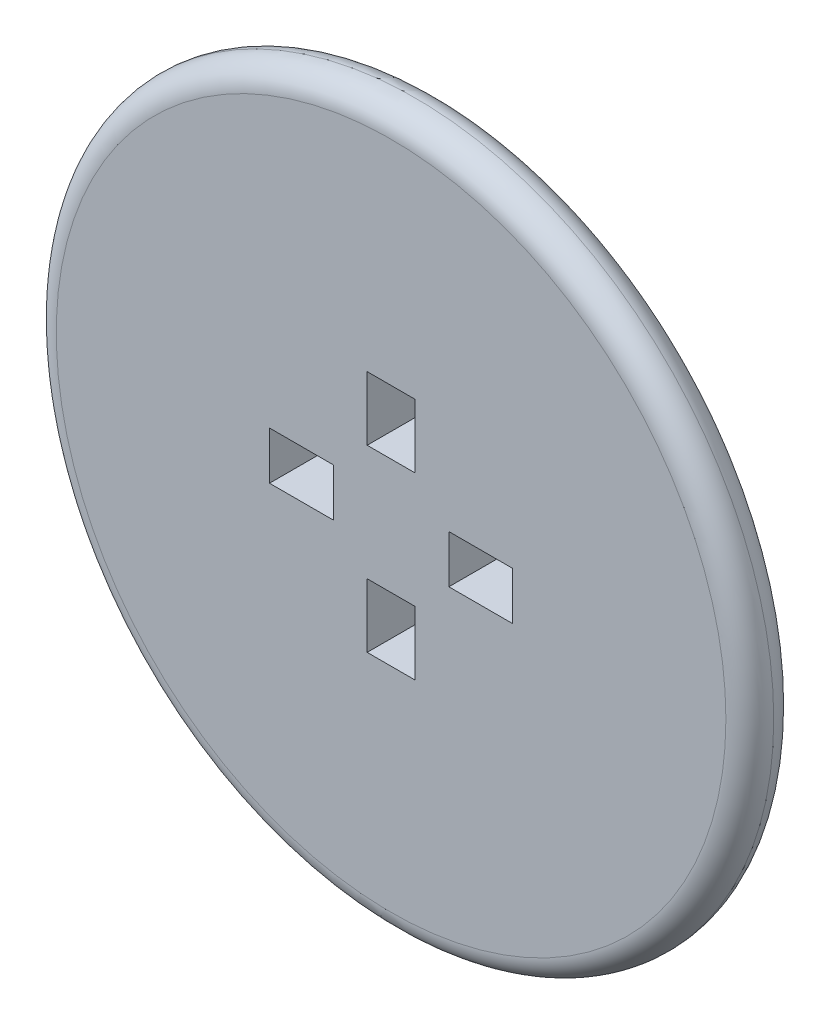
ISO-10303-21;
HEADER;
FILE_DESCRIPTION(('STEP AP214'),'2;1');
FILE_NAME('part.step','',(''),(''),'','','');
FILE_SCHEMA(('AUTOMOTIVE_DESIGN { 1 0 10303 214 1 1 1 1 }'));
ENDSEC;
DATA;
#1=APPLICATION_CONTEXT('core data for automotive mechanical design processes');
#2=APPLICATION_PROTOCOL_DEFINITION('international standard','automotive_design',2000,#1);
#3=PRODUCT_CONTEXT('',#1,'mechanical');
#4=PRODUCT('Part','Part','',(#3));
#5=PRODUCT_RELATED_PRODUCT_CATEGORY('part','',(#4));
#6=PRODUCT_DEFINITION_FORMATION('','',#4);
#7=PRODUCT_DEFINITION_CONTEXT('part definition',#1,'design');
#8=PRODUCT_DEFINITION('design','',#6,#7);
#9=PRODUCT_DEFINITION_SHAPE('','',#8);
#10=(LENGTH_UNIT() NAMED_UNIT(*) SI_UNIT(.MILLI.,.METRE.));
#11=(NAMED_UNIT(*) PLANE_ANGLE_UNIT() SI_UNIT($,.RADIAN.));
#12=(NAMED_UNIT(*) SI_UNIT($,.STERADIAN.) SOLID_ANGLE_UNIT());
#13=UNCERTAINTY_MEASURE_WITH_UNIT(LENGTH_MEASURE(1.E-05),#10,'distance_accuracy_value','');
#14=(GEOMETRIC_REPRESENTATION_CONTEXT(3) GLOBAL_UNCERTAINTY_ASSIGNED_CONTEXT((#13)) GLOBAL_UNIT_ASSIGNED_CONTEXT((#10,
#11,#12)) REPRESENTATION_CONTEXT('',''));
#15=CARTESIAN_POINT('',(0.,0.,0.));
#16=DIRECTION('',(0.,0.,1.));
#17=DIRECTION('',(1.,0.,0.));
#18=AXIS2_PLACEMENT_3D('',#15,#16,#17);
#19=CARTESIAN_POINT('',(0.,0.,6.));
#20=DIRECTION('',(0.,0.,1.));
#21=DIRECTION('',(1.,0.,0.));
#22=AXIS2_PLACEMENT_3D('',#19,#20,#21);
#23=PLANE('',#22);
#24=CARTESIAN_POINT('',(0.,0.,6.));
#25=DIRECTION('',(0.,0.,1.));
#26=DIRECTION('',(1.,0.,0.));
#27=AXIS2_PLACEMENT_3D('',#24,#25,#26);
#28=CIRCLE('',#27,42.);
#29=CARTESIAN_POINT('',(42.,0.,6.));
#30=VERTEX_POINT('',#29);
#31=EDGE_CURVE('E329',#30,#30,#28,.T.);
#32=ORIENTED_EDGE('',*,*,#31,.T.);
#33=EDGE_LOOP('',(#32));
#34=FACE_BOUND('',#33,.T.);
#35=DIRECTION('',(-1.,0.,0.));
#36=VECTOR('',#35,1.);
#37=CARTESIAN_POINT('',(7.25,3.,6.));
#38=LINE('',#37,#36);
#39=CARTESIAN_POINT('',(15.25,3.,6.));
#40=VERTEX_POINT('',#39);
#41=CARTESIAN_POINT('',(7.25,3.,6.));
#42=VERTEX_POINT('',#41);
#43=EDGE_CURVE('E290',#40,#42,#38,.T.);
#44=ORIENTED_EDGE('',*,*,#43,.F.);
#45=DIRECTION('',(0.,1.,0.));
#46=VECTOR('',#45,1.);
#47=CARTESIAN_POINT('',(15.25,3.,6.));
#48=LINE('',#47,#46);
#49=CARTESIAN_POINT('',(15.25,-3.,6.));
#50=VERTEX_POINT('',#49);
#51=EDGE_CURVE('E287',#50,#40,#48,.T.);
#52=ORIENTED_EDGE('',*,*,#51,.F.);
#53=DIRECTION('',(1.,0.,0.));
#54=VECTOR('',#53,1.);
#55=CARTESIAN_POINT('',(7.25,-3.,6.));
#56=LINE('',#55,#54);
#57=CARTESIAN_POINT('',(7.25,-3.,6.));
#58=VERTEX_POINT('',#57);
#59=EDGE_CURVE('E298',#58,#50,#56,.T.);
#60=ORIENTED_EDGE('',*,*,#59,.F.);
#61=DIRECTION('',(0.,-1.,0.));
#62=VECTOR('',#61,1.);
#63=CARTESIAN_POINT('',(7.25,3.,6.));
#64=LINE('',#63,#62);
#65=EDGE_CURVE('E294',#42,#58,#64,.T.);
#66=ORIENTED_EDGE('',*,*,#65,.F.);
#67=EDGE_LOOP('',(#44,#52,#60,#66));
#68=FACE_BOUND('',#67,.T.);
#69=DIRECTION('',(-1.,0.,0.));
#70=VECTOR('',#69,1.);
#71=CARTESIAN_POINT('',(-15.25,2.99999999999999,6.));
#72=LINE('',#71,#70);
#73=CARTESIAN_POINT('',(-7.24999999999999,2.99999999999999,6.));
#74=VERTEX_POINT('',#73);
#75=CARTESIAN_POINT('',(-15.25,2.99999999999999,6.));
#76=VERTEX_POINT('',#75);
#77=EDGE_CURVE('E247',#74,#76,#72,.T.);
#78=ORIENTED_EDGE('',*,*,#77,.F.);
#79=DIRECTION('',(0.,1.,0.));
#80=VECTOR('',#79,1.);
#81=CARTESIAN_POINT('',(-7.24999999999999,-3.00000000000001,6.));
#82=LINE('',#81,#80);
#83=CARTESIAN_POINT('',(-7.24999999999999,-3.00000000000001,6.));
#84=VERTEX_POINT('',#83);
#85=EDGE_CURVE('E244',#84,#74,#82,.T.);
#86=ORIENTED_EDGE('',*,*,#85,.F.);
#87=DIRECTION('',(1.,0.,0.));
#88=VECTOR('',#87,1.);
#89=CARTESIAN_POINT('',(-15.25,-3.00000000000001,6.));
#90=LINE('',#89,#88);
#91=CARTESIAN_POINT('',(-15.25,-3.00000000000001,6.));
#92=VERTEX_POINT('',#91);
#93=EDGE_CURVE('E255',#92,#84,#90,.T.);
#94=ORIENTED_EDGE('',*,*,#93,.F.);
#95=DIRECTION('',(0.,-1.,0.));
#96=VECTOR('',#95,1.);
#97=CARTESIAN_POINT('',(-15.25,-3.00000000000001,6.));
#98=LINE('',#97,#96);
#99=EDGE_CURVE('E251',#76,#92,#98,.T.);
#100=ORIENTED_EDGE('',*,*,#99,.F.);
#101=EDGE_LOOP('',(#78,#86,#94,#100));
#102=FACE_BOUND('',#101,.T.);
#103=DIRECTION('',(-1.,0.,0.));
#104=VECTOR('',#103,1.);
#105=CARTESIAN_POINT('',(-3.,-7.25,6.));
#106=LINE('',#105,#104);
#107=CARTESIAN_POINT('',(3.,-7.25,6.));
#108=VERTEX_POINT('',#107);
#109=CARTESIAN_POINT('',(-3.,-7.25,6.));
#110=VERTEX_POINT('',#109);
#111=EDGE_CURVE('E204',#108,#110,#106,.T.);
#112=ORIENTED_EDGE('',*,*,#111,.F.);
#113=DIRECTION('',(0.,1.,0.));
#114=VECTOR('',#113,1.);
#115=CARTESIAN_POINT('',(3.,-15.25,6.));
#116=LINE('',#115,#114);
#117=CARTESIAN_POINT('',(3.,-15.25,6.));
#118=VERTEX_POINT('',#117);
#119=EDGE_CURVE('E201',#118,#108,#116,.T.);
#120=ORIENTED_EDGE('',*,*,#119,.F.);
#121=DIRECTION('',(1.,0.,0.));
#122=VECTOR('',#121,1.);
#123=CARTESIAN_POINT('',(-3.,-15.25,6.));
#124=LINE('',#123,#122);
#125=CARTESIAN_POINT('',(-3.,-15.25,6.));
#126=VERTEX_POINT('',#125);
#127=EDGE_CURVE('E212',#126,#118,#124,.T.);
#128=ORIENTED_EDGE('',*,*,#127,.F.);
#129=DIRECTION('',(0.,-1.,0.));
#130=VECTOR('',#129,1.);
#131=CARTESIAN_POINT('',(-3.,-15.25,6.));
#132=LINE('',#131,#130);
#133=EDGE_CURVE('E208',#110,#126,#132,.T.);
#134=ORIENTED_EDGE('',*,*,#133,.F.);
#135=EDGE_LOOP('',(#112,#120,#128,#134));
#136=FACE_BOUND('',#135,.T.);
#137=DIRECTION('',(-1.,0.,0.));
#138=VECTOR('',#137,1.);
#139=CARTESIAN_POINT('',(-3.,15.25,6.));
#140=LINE('',#139,#138);
#141=CARTESIAN_POINT('',(3.,15.25,6.));
#142=VERTEX_POINT('',#141);
#143=CARTESIAN_POINT('',(-3.,15.25,6.));
#144=VERTEX_POINT('',#143);
#145=EDGE_CURVE('E162',#142,#144,#140,.T.);
#146=ORIENTED_EDGE('',*,*,#145,.F.);
#147=DIRECTION('',(0.,1.,0.));
#148=VECTOR('',#147,1.);
#149=CARTESIAN_POINT('',(3.,7.25,6.));
#150=LINE('',#149,#148);
#151=CARTESIAN_POINT('',(3.,7.25,6.));
#152=VERTEX_POINT('',#151);
#153=EDGE_CURVE('E153',#152,#142,#150,.T.);
#154=ORIENTED_EDGE('',*,*,#153,.F.);
#155=DIRECTION('',(1.,0.,0.));
#156=VECTOR('',#155,1.);
#157=CARTESIAN_POINT('',(-3.,7.25,6.));
#158=LINE('',#157,#156);
#159=CARTESIAN_POINT('',(-3.,7.25,6.));
#160=VERTEX_POINT('',#159);
#161=EDGE_CURVE('E179',#160,#152,#158,.T.);
#162=ORIENTED_EDGE('',*,*,#161,.F.);
#163=DIRECTION('',(0.,-1.,0.));
#164=VECTOR('',#163,1.);
#165=CARTESIAN_POINT('',(-3.,7.25,6.));
#166=LINE('',#165,#164);
#167=EDGE_CURVE('E175',#144,#160,#166,.T.);
#168=ORIENTED_EDGE('',*,*,#167,.F.);
#169=EDGE_LOOP('',(#146,#154,#162,#168));
#170=FACE_BOUND('',#169,.T.);
#171=ADVANCED_FACE('F39',(#34,#68,#102,#136,#170),#23,.T.);
#172=CARTESIAN_POINT('',(0.,0.,0.));
#173=DIRECTION('',(0.,0.,1.));
#174=DIRECTION('',(1.,0.,0.));
#175=AXIS2_PLACEMENT_3D('',#172,#173,#174);
#176=PLANE('',#175);
#177=CARTESIAN_POINT('',(0.,0.,0.));
#178=DIRECTION('',(0.,0.,1.));
#179=DIRECTION('',(1.,0.,0.));
#180=AXIS2_PLACEMENT_3D('',#177,#178,#179);
#181=CIRCLE('',#180,42.);
#182=CARTESIAN_POINT('',(42.,0.,0.));
#183=VERTEX_POINT('',#182);
#184=EDGE_CURVE('E11',#183,#183,#181,.F.);
#185=ORIENTED_EDGE('',*,*,#184,.T.);
#186=EDGE_LOOP('',(#185));
#187=FACE_BOUND('',#186,.T.);
#188=DIRECTION('',(0.,1.,0.));
#189=VECTOR('',#188,1.);
#190=CARTESIAN_POINT('',(3.,-15.25,0.));
#191=LINE('',#190,#189);
#192=CARTESIAN_POINT('',(3.,-15.25,0.));
#193=VERTEX_POINT('',#192);
#194=CARTESIAN_POINT('',(3.,-7.25,0.));
#195=VERTEX_POINT('',#194);
#196=EDGE_CURVE('E171',#193,#195,#191,.T.);
#197=ORIENTED_EDGE('',*,*,#196,.T.);
#198=DIRECTION('',(-1.,0.,0.));
#199=VECTOR('',#198,1.);
#200=CARTESIAN_POINT('',(-3.,-7.25,0.));
#201=LINE('',#200,#199);
#202=CARTESIAN_POINT('',(-3.,-7.25,0.));
#203=VERTEX_POINT('',#202);
#204=EDGE_CURVE('E219',#195,#203,#201,.T.);
#205=ORIENTED_EDGE('',*,*,#204,.T.);
#206=DIRECTION('',(0.,-1.,0.));
#207=VECTOR('',#206,1.);
#208=CARTESIAN_POINT('',(-3.,-15.25,0.));
#209=LINE('',#208,#207);
#210=CARTESIAN_POINT('',(-3.,-15.25,0.));
#211=VERTEX_POINT('',#210);
#212=EDGE_CURVE('E223',#203,#211,#209,.T.);
#213=ORIENTED_EDGE('',*,*,#212,.T.);
#214=DIRECTION('',(1.,0.,0.));
#215=VECTOR('',#214,1.);
#216=CARTESIAN_POINT('',(-3.,-15.25,0.));
#217=LINE('',#216,#215);
#218=EDGE_CURVE('E205',#211,#193,#217,.T.);
#219=ORIENTED_EDGE('',*,*,#218,.T.);
#220=EDGE_LOOP('',(#197,#205,#213,#219));
#221=FACE_BOUND('',#220,.T.);
#222=DIRECTION('',(0.,1.,0.));
#223=VECTOR('',#222,1.);
#224=CARTESIAN_POINT('',(15.25,3.,0.));
#225=LINE('',#224,#223);
#226=CARTESIAN_POINT('',(15.25,-3.,0.));
#227=VERTEX_POINT('',#226);
#228=CARTESIAN_POINT('',(15.25,3.,0.));
#229=VERTEX_POINT('',#228);
#230=EDGE_CURVE('E286',#227,#229,#225,.T.);
#231=ORIENTED_EDGE('',*,*,#230,.T.);
#232=DIRECTION('',(-1.,0.,0.));
#233=VECTOR('',#232,1.);
#234=CARTESIAN_POINT('',(7.25,3.,0.));
#235=LINE('',#234,#233);
#236=CARTESIAN_POINT('',(7.25,3.,0.));
#237=VERTEX_POINT('',#236);
#238=EDGE_CURVE('E305',#229,#237,#235,.T.);
#239=ORIENTED_EDGE('',*,*,#238,.T.);
#240=DIRECTION('',(0.,-1.,0.));
#241=VECTOR('',#240,1.);
#242=CARTESIAN_POINT('',(7.25,3.,0.));
#243=LINE('',#242,#241);
#244=CARTESIAN_POINT('',(7.25,-3.,0.));
#245=VERTEX_POINT('',#244);
#246=EDGE_CURVE('E309',#237,#245,#243,.T.);
#247=ORIENTED_EDGE('',*,*,#246,.T.);
#248=DIRECTION('',(1.,0.,0.));
#249=VECTOR('',#248,1.);
#250=CARTESIAN_POINT('',(7.25,-3.,0.));
#251=LINE('',#250,#249);
#252=EDGE_CURVE('E291',#245,#227,#251,.T.);
#253=ORIENTED_EDGE('',*,*,#252,.T.);
#254=EDGE_LOOP('',(#231,#239,#247,#253));
#255=FACE_BOUND('',#254,.T.);
#256=DIRECTION('',(0.,1.,0.));
#257=VECTOR('',#256,1.);
#258=CARTESIAN_POINT('',(-7.24999999999999,-3.00000000000001,0.));
#259=LINE('',#258,#257);
#260=CARTESIAN_POINT('',(-7.24999999999999,-3.00000000000001,0.));
#261=VERTEX_POINT('',#260);
#262=CARTESIAN_POINT('',(-7.24999999999999,2.99999999999999,0.));
#263=VERTEX_POINT('',#262);
#264=EDGE_CURVE('E243',#261,#263,#259,.T.);
#265=ORIENTED_EDGE('',*,*,#264,.T.);
#266=DIRECTION('',(-1.,0.,0.));
#267=VECTOR('',#266,1.);
#268=CARTESIAN_POINT('',(-15.25,2.99999999999999,0.));
#269=LINE('',#268,#267);
#270=CARTESIAN_POINT('',(-15.25,2.99999999999999,0.));
#271=VERTEX_POINT('',#270);
#272=EDGE_CURVE('E262',#263,#271,#269,.T.);
#273=ORIENTED_EDGE('',*,*,#272,.T.);
#274=DIRECTION('',(0.,-1.,0.));
#275=VECTOR('',#274,1.);
#276=CARTESIAN_POINT('',(-15.25,-3.00000000000001,0.));
#277=LINE('',#276,#275);
#278=CARTESIAN_POINT('',(-15.25,-3.00000000000001,0.));
#279=VERTEX_POINT('',#278);
#280=EDGE_CURVE('E266',#271,#279,#277,.T.);
#281=ORIENTED_EDGE('',*,*,#280,.T.);
#282=DIRECTION('',(1.,0.,0.));
#283=VECTOR('',#282,1.);
#284=CARTESIAN_POINT('',(-15.25,-3.00000000000001,0.));
#285=LINE('',#284,#283);
#286=EDGE_CURVE('E248',#279,#261,#285,.T.);
#287=ORIENTED_EDGE('',*,*,#286,.T.);
#288=EDGE_LOOP('',(#265,#273,#281,#287));
#289=FACE_BOUND('',#288,.T.);
#290=DIRECTION('',(0.,1.,0.));
#291=VECTOR('',#290,1.);
#292=CARTESIAN_POINT('',(3.,7.25,0.));
#293=LINE('',#292,#291);
#294=CARTESIAN_POINT('',(3.,7.25,0.));
#295=VERTEX_POINT('',#294);
#296=CARTESIAN_POINT('',(3.,15.25,0.));
#297=VERTEX_POINT('',#296);
#298=EDGE_CURVE('E63',#295,#297,#293,.T.);
#299=ORIENTED_EDGE('',*,*,#298,.T.);
#300=DIRECTION('',(-1.,0.,0.));
#301=VECTOR('',#300,1.);
#302=CARTESIAN_POINT('',(-3.,15.25,0.));
#303=LINE('',#302,#301);
#304=CARTESIAN_POINT('',(-3.,15.25,0.));
#305=VERTEX_POINT('',#304);
#306=EDGE_CURVE('E169',#297,#305,#303,.T.);
#307=ORIENTED_EDGE('',*,*,#306,.T.);
#308=DIRECTION('',(0.,-1.,0.));
#309=VECTOR('',#308,1.);
#310=CARTESIAN_POINT('',(-3.,7.25,0.));
#311=LINE('',#310,#309);
#312=CARTESIAN_POINT('',(-3.,7.25,0.));
#313=VERTEX_POINT('',#312);
#314=EDGE_CURVE('E188',#305,#313,#311,.T.);
#315=ORIENTED_EDGE('',*,*,#314,.T.);
#316=DIRECTION('',(1.,0.,0.));
#317=VECTOR('',#316,1.);
#318=CARTESIAN_POINT('',(-3.,7.25,0.));
#319=LINE('',#318,#317);
#320=EDGE_CURVE('E163',#313,#295,#319,.T.);
#321=ORIENTED_EDGE('',*,*,#320,.T.);
#322=EDGE_LOOP('',(#299,#307,#315,#321));
#323=FACE_BOUND('',#322,.T.);
#324=ADVANCED_FACE('F345',(#187,#221,#255,#289,#323),#176,.F.);
#325=CARTESIAN_POINT('',(15.25,3.,6.));
#326=DIRECTION('',(-1.,0.,0.));
#327=DIRECTION('',(0.,0.,1.));
#328=AXIS2_PLACEMENT_3D('',#325,#326,#327);
#329=PLANE('',#328);
#330=ORIENTED_EDGE('',*,*,#230,.F.);
#331=DIRECTION('',(0.,0.,-1.));
#332=VECTOR('',#331,1.);
#333=CARTESIAN_POINT('',(15.25,-3.,6.));
#334=LINE('',#333,#332);
#335=EDGE_CURVE('E301',#50,#227,#334,.T.);
#336=ORIENTED_EDGE('',*,*,#335,.F.);
#337=ORIENTED_EDGE('',*,*,#51,.T.);
#338=DIRECTION('',(0.,0.,-1.));
#339=VECTOR('',#338,1.);
#340=CARTESIAN_POINT('',(15.25,3.,6.));
#341=LINE('',#340,#339);
#342=EDGE_CURVE('E325',#40,#229,#341,.T.);
#343=ORIENTED_EDGE('',*,*,#342,.T.);
#344=EDGE_LOOP('',(#330,#336,#337,#343));
#345=FACE_BOUND('',#344,.T.);
#346=ADVANCED_FACE('F415',(#345),#329,.T.);
#347=CARTESIAN_POINT('',(7.25,3.,6.));
#348=DIRECTION('',(0.,-1.,0.));
#349=DIRECTION('',(0.,0.,-1.));
#350=AXIS2_PLACEMENT_3D('',#347,#348,#349);
#351=PLANE('',#350);
#352=ORIENTED_EDGE('',*,*,#238,.F.);
#353=ORIENTED_EDGE('',*,*,#342,.F.);
#354=ORIENTED_EDGE('',*,*,#43,.T.);
#355=DIRECTION('',(0.,0.,-1.));
#356=VECTOR('',#355,1.);
#357=CARTESIAN_POINT('',(7.25,3.,6.));
#358=LINE('',#357,#356);
#359=EDGE_CURVE('E322',#42,#237,#358,.T.);
#360=ORIENTED_EDGE('',*,*,#359,.T.);
#361=EDGE_LOOP('',(#352,#353,#354,#360));
#362=FACE_BOUND('',#361,.T.);
#363=ADVANCED_FACE('F411',(#362),#351,.T.);
#364=CARTESIAN_POINT('',(7.25,3.,6.));
#365=DIRECTION('',(1.,0.,0.));
#366=DIRECTION('',(0.,0.,-1.));
#367=AXIS2_PLACEMENT_3D('',#364,#365,#366);
#368=PLANE('',#367);
#369=ORIENTED_EDGE('',*,*,#246,.F.);
#370=ORIENTED_EDGE('',*,*,#359,.F.);
#371=ORIENTED_EDGE('',*,*,#65,.T.);
#372=DIRECTION('',(0.,0.,-1.));
#373=VECTOR('',#372,1.);
#374=CARTESIAN_POINT('',(7.25,-3.,6.));
#375=LINE('',#374,#373);
#376=EDGE_CURVE('E319',#58,#245,#375,.T.);
#377=ORIENTED_EDGE('',*,*,#376,.T.);
#378=EDGE_LOOP('',(#369,#370,#371,#377));
#379=FACE_BOUND('',#378,.T.);
#380=ADVANCED_FACE('F407',(#379),#368,.T.);
#381=CARTESIAN_POINT('',(7.25,-3.,6.));
#382=DIRECTION('',(0.,1.,0.));
#383=DIRECTION('',(0.,0.,1.));
#384=AXIS2_PLACEMENT_3D('',#381,#382,#383);
#385=PLANE('',#384);
#386=ORIENTED_EDGE('',*,*,#252,.F.);
#387=ORIENTED_EDGE('',*,*,#376,.F.);
#388=ORIENTED_EDGE('',*,*,#59,.T.);
#389=ORIENTED_EDGE('',*,*,#335,.T.);
#390=EDGE_LOOP('',(#386,#387,#388,#389));
#391=FACE_BOUND('',#390,.T.);
#392=ADVANCED_FACE('F403',(#391),#385,.T.);
#393=CARTESIAN_POINT('',(-7.24999999999999,-3.00000000000001,6.));
#394=DIRECTION('',(-1.,0.,0.));
#395=DIRECTION('',(0.,0.,1.));
#396=AXIS2_PLACEMENT_3D('',#393,#394,#395);
#397=PLANE('',#396);
#398=ORIENTED_EDGE('',*,*,#264,.F.);
#399=DIRECTION('',(0.,0.,-1.));
#400=VECTOR('',#399,1.);
#401=CARTESIAN_POINT('',(-7.24999999999999,-3.00000000000001,6.));
#402=LINE('',#401,#400);
#403=EDGE_CURVE('E258',#84,#261,#402,.T.);
#404=ORIENTED_EDGE('',*,*,#403,.F.);
#405=ORIENTED_EDGE('',*,*,#85,.T.);
#406=DIRECTION('',(0.,0.,-1.));
#407=VECTOR('',#406,1.);
#408=CARTESIAN_POINT('',(-7.24999999999999,2.99999999999999,6.));
#409=LINE('',#408,#407);
#410=EDGE_CURVE('E282',#74,#263,#409,.T.);
#411=ORIENTED_EDGE('',*,*,#410,.T.);
#412=EDGE_LOOP('',(#398,#404,#405,#411));
#413=FACE_BOUND('',#412,.T.);
#414=ADVANCED_FACE('F399',(#413),#397,.T.);
#415=CARTESIAN_POINT('',(-15.25,2.99999999999999,6.));
#416=DIRECTION('',(0.,-1.,0.));
#417=DIRECTION('',(1.,0.,0.));
#418=AXIS2_PLACEMENT_3D('',#415,#416,#417);
#419=PLANE('',#418);
#420=ORIENTED_EDGE('',*,*,#272,.F.);
#421=ORIENTED_EDGE('',*,*,#410,.F.);
#422=ORIENTED_EDGE('',*,*,#77,.T.);
#423=DIRECTION('',(0.,0.,-1.));
#424=VECTOR('',#423,1.);
#425=CARTESIAN_POINT('',(-15.25,2.99999999999999,6.));
#426=LINE('',#425,#424);
#427=EDGE_CURVE('E279',#76,#271,#426,.T.);
#428=ORIENTED_EDGE('',*,*,#427,.T.);
#429=EDGE_LOOP('',(#420,#421,#422,#428));
#430=FACE_BOUND('',#429,.T.);
#431=ADVANCED_FACE('F395',(#430),#419,.T.);
#432=CARTESIAN_POINT('',(-15.25,-3.00000000000001,6.));
#433=DIRECTION('',(1.,0.,0.));
#434=DIRECTION('',(0.,0.,-1.));
#435=AXIS2_PLACEMENT_3D('',#432,#433,#434);
#436=PLANE('',#435);
#437=ORIENTED_EDGE('',*,*,#280,.F.);
#438=ORIENTED_EDGE('',*,*,#427,.F.);
#439=ORIENTED_EDGE('',*,*,#99,.T.);
#440=DIRECTION('',(0.,0.,-1.));
#441=VECTOR('',#440,1.);
#442=CARTESIAN_POINT('',(-15.25,-3.00000000000001,6.));
#443=LINE('',#442,#441);
#444=EDGE_CURVE('E276',#92,#279,#443,.T.);
#445=ORIENTED_EDGE('',*,*,#444,.T.);
#446=EDGE_LOOP('',(#437,#438,#439,#445));
#447=FACE_BOUND('',#446,.T.);
#448=ADVANCED_FACE('F391',(#447),#436,.T.);
#449=CARTESIAN_POINT('',(-15.25,-3.00000000000001,6.));
#450=DIRECTION('',(0.,1.,0.));
#451=DIRECTION('',(-1.,0.,0.));
#452=AXIS2_PLACEMENT_3D('',#449,#450,#451);
#453=PLANE('',#452);
#454=ORIENTED_EDGE('',*,*,#286,.F.);
#455=ORIENTED_EDGE('',*,*,#444,.F.);
#456=ORIENTED_EDGE('',*,*,#93,.T.);
#457=ORIENTED_EDGE('',*,*,#403,.T.);
#458=EDGE_LOOP('',(#454,#455,#456,#457));
#459=FACE_BOUND('',#458,.T.);
#460=ADVANCED_FACE('F388',(#459),#453,.T.);
#461=CARTESIAN_POINT('',(3.,-15.25,6.));
#462=DIRECTION('',(-1.,0.,0.));
#463=DIRECTION('',(0.,0.,1.));
#464=AXIS2_PLACEMENT_3D('',#461,#462,#463);
#465=PLANE('',#464);
#466=ORIENTED_EDGE('',*,*,#196,.F.);
#467=DIRECTION('',(0.,0.,-1.));
#468=VECTOR('',#467,1.);
#469=CARTESIAN_POINT('',(3.,-15.25,6.));
#470=LINE('',#469,#468);
#471=EDGE_CURVE('E215',#118,#193,#470,.T.);
#472=ORIENTED_EDGE('',*,*,#471,.F.);
#473=ORIENTED_EDGE('',*,*,#119,.T.);
#474=DIRECTION('',(0.,0.,-1.));
#475=VECTOR('',#474,1.);
#476=CARTESIAN_POINT('',(3.,-7.25,6.));
#477=LINE('',#476,#475);
#478=EDGE_CURVE('E239',#108,#195,#477,.T.);
#479=ORIENTED_EDGE('',*,*,#478,.T.);
#480=EDGE_LOOP('',(#466,#472,#473,#479));
#481=FACE_BOUND('',#480,.T.);
#482=ADVANCED_FACE('F370',(#481),#465,.T.);
#483=CARTESIAN_POINT('',(-3.,-7.25,6.));
#484=DIRECTION('',(0.,-1.,0.));
#485=DIRECTION('',(0.,0.,-1.));
#486=AXIS2_PLACEMENT_3D('',#483,#484,#485);
#487=PLANE('',#486);
#488=ORIENTED_EDGE('',*,*,#204,.F.);
#489=ORIENTED_EDGE('',*,*,#478,.F.);
#490=ORIENTED_EDGE('',*,*,#111,.T.);
#491=DIRECTION('',(0.,0.,-1.));
#492=VECTOR('',#491,1.);
#493=CARTESIAN_POINT('',(-3.,-7.25,6.));
#494=LINE('',#493,#492);
#495=EDGE_CURVE('E236',#110,#203,#494,.T.);
#496=ORIENTED_EDGE('',*,*,#495,.T.);
#497=EDGE_LOOP('',(#488,#489,#490,#496));
#498=FACE_BOUND('',#497,.T.);
#499=ADVANCED_FACE('F362',(#498),#487,.T.);
#500=CARTESIAN_POINT('',(-3.,-15.25,6.));
#501=DIRECTION('',(1.,0.,0.));
#502=DIRECTION('',(0.,0.,-1.));
#503=AXIS2_PLACEMENT_3D('',#500,#501,#502);
#504=PLANE('',#503);
#505=ORIENTED_EDGE('',*,*,#212,.F.);
#506=ORIENTED_EDGE('',*,*,#495,.F.);
#507=ORIENTED_EDGE('',*,*,#133,.T.);
#508=DIRECTION('',(0.,0.,-1.));
#509=VECTOR('',#508,1.);
#510=CARTESIAN_POINT('',(-3.,-15.25,6.));
#511=LINE('',#510,#509);
#512=EDGE_CURVE('E233',#126,#211,#511,.T.);
#513=ORIENTED_EDGE('',*,*,#512,.T.);
#514=EDGE_LOOP('',(#505,#506,#507,#513));
#515=FACE_BOUND('',#514,.T.);
#516=ADVANCED_FACE('F365',(#515),#504,.T.);
#517=CARTESIAN_POINT('',(-3.,-15.25,6.));
#518=DIRECTION('',(0.,1.,0.));
#519=DIRECTION('',(0.,0.,1.));
#520=AXIS2_PLACEMENT_3D('',#517,#518,#519);
#521=PLANE('',#520);
#522=ORIENTED_EDGE('',*,*,#218,.F.);
#523=ORIENTED_EDGE('',*,*,#512,.F.);
#524=ORIENTED_EDGE('',*,*,#127,.T.);
#525=ORIENTED_EDGE('',*,*,#471,.T.);
#526=EDGE_LOOP('',(#522,#523,#524,#525));
#527=FACE_BOUND('',#526,.T.);
#528=ADVANCED_FACE('F373',(#527),#521,.T.);
#529=CARTESIAN_POINT('',(3.,7.25,6.));
#530=DIRECTION('',(-1.,0.,0.));
#531=DIRECTION('',(0.,0.,1.));
#532=AXIS2_PLACEMENT_3D('',#529,#530,#531);
#533=PLANE('',#532);
#534=ORIENTED_EDGE('',*,*,#298,.F.);
#535=DIRECTION('',(0.,0.,-1.));
#536=VECTOR('',#535,1.);
#537=CARTESIAN_POINT('',(3.,7.25,6.));
#538=LINE('',#537,#536);
#539=EDGE_CURVE('E157',#152,#295,#538,.T.);
#540=ORIENTED_EDGE('',*,*,#539,.F.);
#541=ORIENTED_EDGE('',*,*,#153,.T.);
#542=DIRECTION('',(0.,0.,-1.));
#543=VECTOR('',#542,1.);
#544=CARTESIAN_POINT('',(3.,15.25,6.));
#545=LINE('',#544,#543);
#546=EDGE_CURVE('E156',#142,#297,#545,.T.);
#547=ORIENTED_EDGE('',*,*,#546,.T.);
#548=EDGE_LOOP('',(#534,#540,#541,#547));
#549=FACE_BOUND('',#548,.T.);
#550=ADVANCED_FACE('F155',(#549),#533,.T.);
#551=CARTESIAN_POINT('',(-3.,15.25,6.));
#552=DIRECTION('',(0.,-1.,0.));
#553=DIRECTION('',(0.,0.,-1.));
#554=AXIS2_PLACEMENT_3D('',#551,#552,#553);
#555=PLANE('',#554);
#556=ORIENTED_EDGE('',*,*,#306,.F.);
#557=ORIENTED_EDGE('',*,*,#546,.F.);
#558=ORIENTED_EDGE('',*,*,#145,.T.);
#559=DIRECTION('',(0.,0.,-1.));
#560=VECTOR('',#559,1.);
#561=CARTESIAN_POINT('',(-3.,15.25,6.));
#562=LINE('',#561,#560);
#563=EDGE_CURVE('E172',#144,#305,#562,.T.);
#564=ORIENTED_EDGE('',*,*,#563,.T.);
#565=EDGE_LOOP('',(#556,#557,#558,#564));
#566=FACE_BOUND('',#565,.T.);
#567=ADVANCED_FACE('F166',(#566),#555,.T.);
#568=CARTESIAN_POINT('',(-3.,7.25,6.));
#569=DIRECTION('',(1.,0.,0.));
#570=DIRECTION('',(0.,0.,-1.));
#571=AXIS2_PLACEMENT_3D('',#568,#569,#570);
#572=PLANE('',#571);
#573=ORIENTED_EDGE('',*,*,#314,.F.);
#574=ORIENTED_EDGE('',*,*,#563,.F.);
#575=ORIENTED_EDGE('',*,*,#167,.T.);
#576=DIRECTION('',(0.,0.,-1.));
#577=VECTOR('',#576,1.);
#578=CARTESIAN_POINT('',(-3.,7.25,6.));
#579=LINE('',#578,#577);
#580=EDGE_CURVE('E55',#160,#313,#579,.T.);
#581=ORIENTED_EDGE('',*,*,#580,.T.);
#582=EDGE_LOOP('',(#573,#574,#575,#581));
#583=FACE_BOUND('',#582,.T.);
#584=ADVANCED_FACE('F440',(#583),#572,.T.);
#585=CARTESIAN_POINT('',(-3.,7.25,6.));
#586=DIRECTION('',(0.,1.,0.));
#587=DIRECTION('',(-1.,0.,0.));
#588=AXIS2_PLACEMENT_3D('',#585,#586,#587);
#589=PLANE('',#588);
#590=ORIENTED_EDGE('',*,*,#320,.F.);
#591=ORIENTED_EDGE('',*,*,#580,.F.);
#592=ORIENTED_EDGE('',*,*,#161,.T.);
#593=ORIENTED_EDGE('',*,*,#539,.T.);
#594=EDGE_LOOP('',(#590,#591,#592,#593));
#595=FACE_BOUND('',#594,.T.);
#596=ADVANCED_FACE('F340',(#595),#589,.T.);
#597=CARTESIAN_POINT('',(0.,0.,3.));
#598=DIRECTION('',(0.,0.,1.));
#599=DIRECTION('',(1.,0.,0.));
#600=AXIS2_PLACEMENT_3D('',#597,#598,#599);
#601=TOROIDAL_SURFACE('',#600,42.,3.);
#602=CARTESIAN_POINT('',(0.,0.,3.));
#603=DIRECTION('',(0.,0.,1.));
#604=DIRECTION('',(1.,0.,0.));
#605=AXIS2_PLACEMENT_3D('',#602,#603,#604);
#606=CIRCLE('',#605,45.);
#607=CARTESIAN_POINT('',(45.,0.,3.));
#608=VERTEX_POINT('',#607);
#609=EDGE_CURVE('E48',#608,#608,#606,.F.);
#610=ORIENTED_EDGE('',*,*,#609,.F.);
#611=EDGE_LOOP('',(#610));
#612=FACE_BOUND('',#611,.T.);
#613=ORIENTED_EDGE('',*,*,#31,.F.);
#614=EDGE_LOOP('',(#613));
#615=FACE_BOUND('',#614,.T.);
#616=ADVANCED_FACE('F337',(#612,#615),#601,.T.);
#617=CARTESIAN_POINT('',(0.,0.,3.));
#618=DIRECTION('',(0.,0.,1.));
#619=DIRECTION('',(1.,0.,0.));
#620=AXIS2_PLACEMENT_3D('',#617,#618,#619);
#621=TOROIDAL_SURFACE('',#620,42.,3.);
#622=ORIENTED_EDGE('',*,*,#184,.F.);
#623=EDGE_LOOP('',(#622));
#624=FACE_BOUND('',#623,.T.);
#625=ORIENTED_EDGE('',*,*,#609,.T.);
#626=EDGE_LOOP('',(#625));
#627=FACE_BOUND('',#626,.T.);
#628=ADVANCED_FACE('F41',(#624,#627),#621,.T.);
#629=CLOSED_SHELL('',(#171,#324,#346,#363,#380,#392,#414,#431,#448,#460,#482,#499,#516,#528,
#550,#567,#584,#596,#616,#628));
#630=MANIFOLD_SOLID_BREP('B2',#629);
#631=ADVANCED_BREP_SHAPE_REPRESENTATION('',(#18,#630),#14);
#632=SHAPE_DEFINITION_REPRESENTATION(#9,#631);
ENDSEC;
END-ISO-10303-21;
